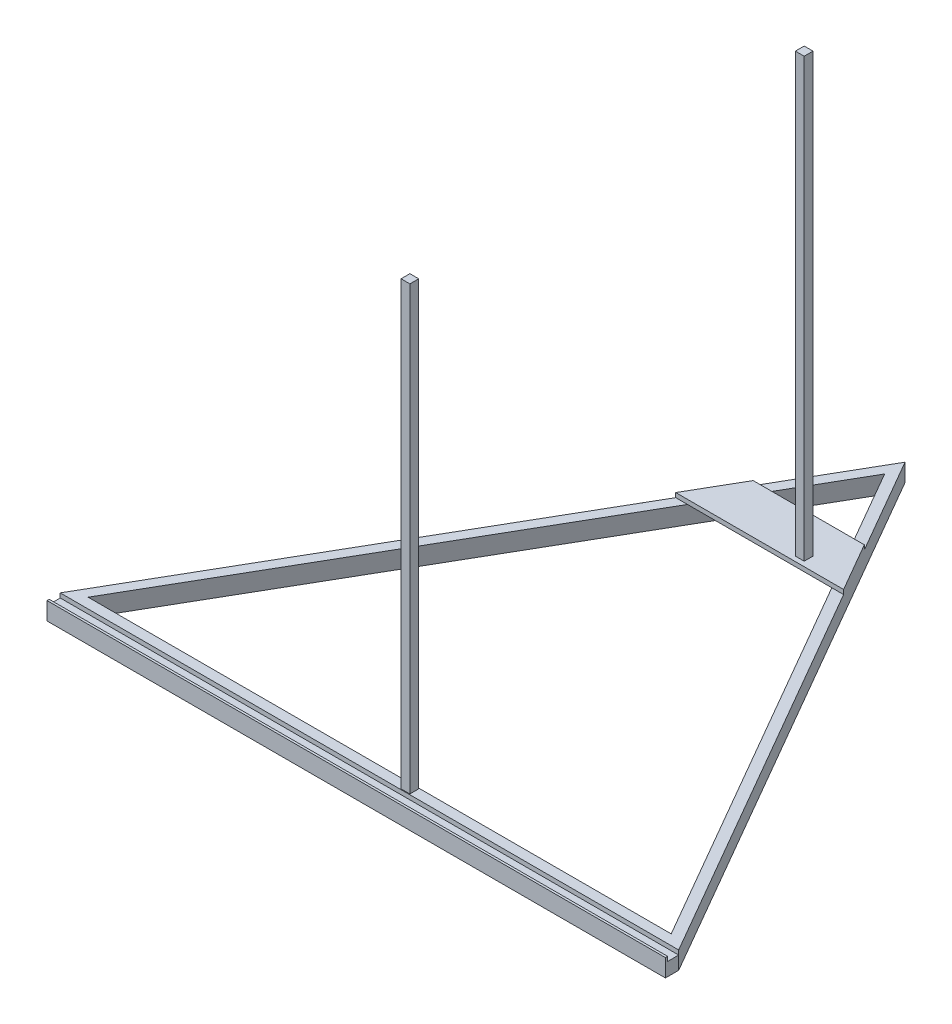
ISO-10303-21;
HEADER;
FILE_DESCRIPTION(('STEP AP214'),'2;1');
FILE_NAME('part.step','',(''),(''),'','','');
FILE_SCHEMA(('AUTOMOTIVE_DESIGN { 1 0 10303 214 1 1 1 1 }'));
ENDSEC;
DATA;
#1=APPLICATION_CONTEXT('core data for automotive mechanical design processes');
#2=APPLICATION_PROTOCOL_DEFINITION('international standard','automotive_design',2000,#1);
#3=PRODUCT_CONTEXT('',#1,'mechanical');
#4=PRODUCT('Part','Part','',(#3));
#5=PRODUCT_RELATED_PRODUCT_CATEGORY('part','',(#4));
#6=PRODUCT_DEFINITION_FORMATION('','',#4);
#7=PRODUCT_DEFINITION_CONTEXT('part definition',#1,'design');
#8=PRODUCT_DEFINITION('design','',#6,#7);
#9=PRODUCT_DEFINITION_SHAPE('','',#8);
#10=(LENGTH_UNIT() NAMED_UNIT(*) SI_UNIT(.MILLI.,.METRE.));
#11=(NAMED_UNIT(*) PLANE_ANGLE_UNIT() SI_UNIT($,.RADIAN.));
#12=(NAMED_UNIT(*) SI_UNIT($,.STERADIAN.) SOLID_ANGLE_UNIT());
#13=UNCERTAINTY_MEASURE_WITH_UNIT(LENGTH_MEASURE(1.E-05),#10,'distance_accuracy_value','');
#14=(GEOMETRIC_REPRESENTATION_CONTEXT(3) GLOBAL_UNCERTAINTY_ASSIGNED_CONTEXT((#13)) GLOBAL_UNIT_ASSIGNED_CONTEXT((#10,
#11,#12)) REPRESENTATION_CONTEXT('',''));
#15=CARTESIAN_POINT('',(0.,0.,0.));
#16=DIRECTION('',(0.,0.,1.));
#17=DIRECTION('',(1.,0.,0.));
#18=AXIS2_PLACEMENT_3D('',#15,#16,#17);
#19=CARTESIAN_POINT('',(0.,20.,0.));
#20=DIRECTION('',(0.,1.,0.));
#21=DIRECTION('',(0.,0.,1.));
#22=AXIS2_PLACEMENT_3D('',#19,#20,#21);
#23=PLANE('',#22);
#24=DIRECTION('',(1.,0.,0.));
#25=VECTOR('',#24,1.);
#26=CARTESIAN_POINT('',(350.,20.,214.572594216369));
#27=LINE('',#26,#25);
#28=CARTESIAN_POINT('',(-350.,20.,214.572594216369));
#29=VERTEX_POINT('',#28);
#30=CARTESIAN_POINT('',(350.,20.,214.572594216369));
#31=VERTEX_POINT('',#30);
#32=EDGE_CURVE('E216',#29,#31,#27,.T.);
#33=ORIENTED_EDGE('',*,*,#32,.F.);
#34=DIRECTION('',(0.,0.,1.));
#35=VECTOR('',#34,1.);
#36=CARTESIAN_POINT('',(-350.,20.,202.072594216369));
#37=LINE('',#36,#35);
#38=CARTESIAN_POINT('',(-350.,20.,217.072594216369));
#39=VERTEX_POINT('',#38);
#40=EDGE_CURVE('E279',#29,#39,#37,.T.);
#41=ORIENTED_EDGE('',*,*,#40,.T.);
#42=DIRECTION('',(1.,0.,0.));
#43=VECTOR('',#42,1.);
#44=CARTESIAN_POINT('',(-350.,20.,217.072594216369));
#45=LINE('',#44,#43);
#46=CARTESIAN_POINT('',(350.,20.,217.072594216369));
#47=VERTEX_POINT('',#46);
#48=EDGE_CURVE('E288',#39,#47,#45,.T.);
#49=ORIENTED_EDGE('',*,*,#48,.T.);
#50=DIRECTION('',(0.,0.,1.));
#51=VECTOR('',#50,1.);
#52=CARTESIAN_POINT('',(350.,20.,202.072594216369));
#53=LINE('',#52,#51);
#54=EDGE_CURVE('E277',#31,#47,#53,.T.);
#55=ORIENTED_EDGE('',*,*,#54,.F.);
#56=EDGE_LOOP('',(#33,#41,#49,#55));
#57=FACE_BOUND('',#56,.T.);
#58=ADVANCED_FACE('F33',(#57),#23,.T.);
#59=CARTESIAN_POINT('',(0.,25.,0.));
#60=DIRECTION('',(0.,1.,0.));
#61=DIRECTION('',(0.,0.,1.));
#62=AXIS2_PLACEMENT_3D('',#59,#60,#61);
#63=PLANE('',#62);
#64=DIRECTION('',(-0.5,0.,-0.866025403784438));
#65=VECTOR('',#64,1.);
#66=CARTESIAN_POINT('',(95.0000000000002,25.,-239.600361713695));
#67=LINE('',#66,#65);
#68=CARTESIAN_POINT('',(95.0000000000002,25.,-239.600361713695));
#69=VERTEX_POINT('',#68);
#70=CARTESIAN_POINT('',(62.9420736397741,25.,-295.126318954908));
#71=VERTEX_POINT('',#70);
#72=EDGE_CURVE('E335',#69,#71,#67,.T.);
#73=ORIENTED_EDGE('',*,*,#72,.T.);
#74=DIRECTION('',(-1.,0.,0.));
#75=VECTOR('',#74,1.);
#76=CARTESIAN_POINT('',(62.9420736397741,25.,-295.126318954908));
#77=LINE('',#76,#75);
#78=CARTESIAN_POINT('',(-62.942073639774,25.,-295.126318954908));
#79=VERTEX_POINT('',#78);
#80=EDGE_CURVE('E345',#71,#79,#77,.T.);
#81=ORIENTED_EDGE('',*,*,#80,.T.);
#82=DIRECTION('',(-0.5,0.,0.866025403784439));
#83=VECTOR('',#82,1.);
#84=CARTESIAN_POINT('',(-62.942073639774,25.,-295.126318954908));
#85=LINE('',#84,#83);
#86=CARTESIAN_POINT('',(-95.,25.,-239.600361713695));
#87=VERTEX_POINT('',#86);
#88=EDGE_CURVE('E343',#79,#87,#85,.T.);
#89=ORIENTED_EDGE('',*,*,#88,.T.);
#90=DIRECTION('',(1.,0.,0.));
#91=VECTOR('',#90,1.);
#92=CARTESIAN_POINT('',(-95.,25.,-239.600361713695));
#93=LINE('',#92,#91);
#94=EDGE_CURVE('E332',#87,#69,#93,.T.);
#95=ORIENTED_EDGE('',*,*,#94,.T.);
#96=EDGE_LOOP('',(#73,#81,#89,#95));
#97=FACE_BOUND('',#96,.T.);
#98=DIRECTION('',(1.,0.,0.));
#99=VECTOR('',#98,1.);
#100=CARTESIAN_POINT('',(34.9999999999999,25.,-245.));
#101=LINE('',#100,#99);
#102=CARTESIAN_POINT('',(34.9999999999999,25.,-245.));
#103=VERTEX_POINT('',#102);
#104=CARTESIAN_POINT('',(45.,25.,-245.));
#105=VERTEX_POINT('',#104);
#106=EDGE_CURVE('E364',#103,#105,#101,.T.);
#107=ORIENTED_EDGE('',*,*,#106,.F.);
#108=DIRECTION('',(0.,0.,1.));
#109=VECTOR('',#108,1.);
#110=CARTESIAN_POINT('',(35.,25.,-255.));
#111=LINE('',#110,#109);
#112=CARTESIAN_POINT('',(35.,25.,-255.));
#113=VERTEX_POINT('',#112);
#114=EDGE_CURVE('E366',#113,#103,#111,.T.);
#115=ORIENTED_EDGE('',*,*,#114,.F.);
#116=DIRECTION('',(-1.,0.,0.));
#117=VECTOR('',#116,1.);
#118=CARTESIAN_POINT('',(45.0000000000001,25.,-255.));
#119=LINE('',#118,#117);
#120=CARTESIAN_POINT('',(45.0000000000001,25.,-255.));
#121=VERTEX_POINT('',#120);
#122=EDGE_CURVE('E359',#121,#113,#119,.T.);
#123=ORIENTED_EDGE('',*,*,#122,.F.);
#124=DIRECTION('',(0.,0.,-1.));
#125=VECTOR('',#124,1.);
#126=CARTESIAN_POINT('',(45.,25.,-245.));
#127=LINE('',#126,#125);
#128=EDGE_CURVE('E362',#105,#121,#127,.T.);
#129=ORIENTED_EDGE('',*,*,#128,.F.);
#130=EDGE_LOOP('',(#107,#115,#123,#129));
#131=FACE_BOUND('',#130,.T.);
#132=ADVANCED_FACE('F430',(#97,#131),#63,.T.);
#133=DIRECTION('',(-0.5,0.,0.866025403784439));
#134=VECTOR('',#133,1.);
#135=CARTESIAN_POINT('',(0.,20.,-404.145188432738));
#136=LINE('',#135,#134);
#137=CARTESIAN_POINT('',(0.,20.,-404.145188432738));
#138=VERTEX_POINT('',#137);
#139=CARTESIAN_POINT('',(-62.942073639774,20.,-295.126318954908));
#140=VERTEX_POINT('',#139);
#141=EDGE_CURVE('E226',#138,#140,#136,.T.);
#142=ORIENTED_EDGE('',*,*,#141,.T.);
#143=DIRECTION('',(-1.,0.,0.));
#144=VECTOR('',#143,1.);
#145=CARTESIAN_POINT('',(62.9420736397741,20.,-295.126318954908));
#146=LINE('',#145,#144);
#147=CARTESIAN_POINT('',(-49.6087403064406,20.,-295.126318954908));
#148=VERTEX_POINT('',#147);
#149=EDGE_CURVE('E341',#148,#140,#146,.T.);
#150=ORIENTED_EDGE('',*,*,#149,.F.);
#151=DIRECTION('',(-0.5,0.,0.866025403784439));
#152=VECTOR('',#151,1.);
#153=CARTESIAN_POINT('',(0.,20.,-381.051177665153));
#154=LINE('',#153,#152);
#155=CARTESIAN_POINT('',(0.,20.,-381.051177665153));
#156=VERTEX_POINT('',#155);
#157=EDGE_CURVE('E265',#156,#148,#154,.T.);
#158=ORIENTED_EDGE('',*,*,#157,.F.);
#159=DIRECTION('',(-0.5,0.,-0.866025403784439));
#160=VECTOR('',#159,1.);
#161=CARTESIAN_POINT('',(330.,20.,190.525588832576));
#162=LINE('',#161,#160);
#163=CARTESIAN_POINT('',(49.6087403064406,20.,-295.126318954908));
#164=VERTEX_POINT('',#163);
#165=EDGE_CURVE('E256',#164,#156,#162,.T.);
#166=ORIENTED_EDGE('',*,*,#165,.F.);
#167=CARTESIAN_POINT('',(62.9420736397741,20.,-295.126318954908));
#168=VERTEX_POINT('',#167);
#169=EDGE_CURVE('E338',#168,#164,#146,.T.);
#170=ORIENTED_EDGE('',*,*,#169,.F.);
#171=DIRECTION('',(-0.5,0.,-0.866025403784438));
#172=VECTOR('',#171,1.);
#173=CARTESIAN_POINT('',(350.,20.,202.072594216369));
#174=LINE('',#173,#172);
#175=EDGE_CURVE('E237',#168,#138,#174,.T.);
#176=ORIENTED_EDGE('',*,*,#175,.T.);
#177=EDGE_LOOP('',(#142,#150,#158,#166,#170,#176));
#178=FACE_BOUND('',#177,.T.);
#179=ADVANCED_FACE('F413',(#178),#23,.T.);
#180=DIRECTION('',(-1.,0.,0.));
#181=VECTOR('',#180,1.);
#182=CARTESIAN_POINT('',(350.,20.,202.072594216369));
#183=LINE('',#182,#181);
#184=CARTESIAN_POINT('',(350.,20.,202.072594216369));
#185=VERTEX_POINT('',#184);
#186=CARTESIAN_POINT('',(-350.,20.,202.072594216369));
#187=VERTEX_POINT('',#186);
#188=EDGE_CURVE('E381',#185,#187,#183,.T.);
#189=ORIENTED_EDGE('',*,*,#188,.F.);
#190=CARTESIAN_POINT('',(95.0000000000002,20.,-239.600361713695));
#191=VERTEX_POINT('',#190);
#192=EDGE_CURVE('E231',#185,#191,#174,.T.);
#193=ORIENTED_EDGE('',*,*,#192,.T.);
#194=DIRECTION('',(1.,0.,0.));
#195=VECTOR('',#194,1.);
#196=CARTESIAN_POINT('',(-95.,20.,-239.600361713695));
#197=LINE('',#196,#195);
#198=CARTESIAN_POINT('',(81.6666666666666,20.,-239.600361713695));
#199=VERTEX_POINT('',#198);
#200=EDGE_CURVE('E337',#199,#191,#197,.T.);
#201=ORIENTED_EDGE('',*,*,#200,.F.);
#202=CARTESIAN_POINT('',(330.,20.,190.525588832576));
#203=VERTEX_POINT('',#202);
#204=EDGE_CURVE('E270',#203,#199,#162,.T.);
#205=ORIENTED_EDGE('',*,*,#204,.F.);
#206=DIRECTION('',(1.,0.,0.));
#207=VECTOR('',#206,1.);
#208=CARTESIAN_POINT('',(-330.,20.,190.525588832577));
#209=LINE('',#208,#207);
#210=CARTESIAN_POINT('',(-330.,20.,190.525588832577));
#211=VERTEX_POINT('',#210);
#212=EDGE_CURVE('E252',#211,#203,#209,.T.);
#213=ORIENTED_EDGE('',*,*,#212,.F.);
#214=CARTESIAN_POINT('',(-81.6666666666667,20.,-239.600361713695));
#215=VERTEX_POINT('',#214);
#216=EDGE_CURVE('E269',#215,#211,#154,.T.);
#217=ORIENTED_EDGE('',*,*,#216,.F.);
#218=CARTESIAN_POINT('',(-95.,20.,-239.600361713695));
#219=VERTEX_POINT('',#218);
#220=EDGE_CURVE('E333',#219,#215,#197,.T.);
#221=ORIENTED_EDGE('',*,*,#220,.F.);
#222=EDGE_CURVE('E243',#219,#187,#136,.T.);
#223=ORIENTED_EDGE('',*,*,#222,.T.);
#224=EDGE_LOOP('',(#189,#193,#201,#205,#213,#217,#221,#223));
#225=FACE_BOUND('',#224,.T.);
#226=DIRECTION('',(1.,0.,0.));
#227=VECTOR('',#226,1.);
#228=CARTESIAN_POINT('',(35.0000000000001,20.,201.3));
#229=LINE('',#228,#227);
#230=CARTESIAN_POINT('',(35.0000000000001,20.,201.3));
#231=VERTEX_POINT('',#230);
#232=CARTESIAN_POINT('',(45.0000000000001,20.,201.3));
#233=VERTEX_POINT('',#232);
#234=EDGE_CURVE('E308',#231,#233,#229,.T.);
#235=ORIENTED_EDGE('',*,*,#234,.F.);
#236=DIRECTION('',(0.,0.,1.));
#237=VECTOR('',#236,1.);
#238=CARTESIAN_POINT('',(34.9999999999998,20.,191.3));
#239=LINE('',#238,#237);
#240=CARTESIAN_POINT('',(34.9999999999998,20.,191.3));
#241=VERTEX_POINT('',#240);
#242=EDGE_CURVE('E310',#241,#231,#239,.T.);
#243=ORIENTED_EDGE('',*,*,#242,.F.);
#244=DIRECTION('',(-1.,0.,0.));
#245=VECTOR('',#244,1.);
#246=CARTESIAN_POINT('',(44.9999999999999,20.,191.3));
#247=LINE('',#246,#245);
#248=CARTESIAN_POINT('',(44.9999999999999,20.,191.3));
#249=VERTEX_POINT('',#248);
#250=EDGE_CURVE('E302',#249,#241,#247,.T.);
#251=ORIENTED_EDGE('',*,*,#250,.F.);
#252=DIRECTION('',(0.,0.,-1.));
#253=VECTOR('',#252,1.);
#254=CARTESIAN_POINT('',(45.0000000000001,20.,201.3));
#255=LINE('',#254,#253);
#256=EDGE_CURVE('E305',#233,#249,#255,.T.);
#257=ORIENTED_EDGE('',*,*,#256,.F.);
#258=EDGE_LOOP('',(#235,#243,#251,#257));
#259=FACE_BOUND('',#258,.T.);
#260=ADVANCED_FACE('F437',(#225,#259),#23,.T.);
#261=CARTESIAN_POINT('',(0.,0.,0.));
#262=DIRECTION('',(0.,1.,0.));
#263=DIRECTION('',(0.,0.,1.));
#264=AXIS2_PLACEMENT_3D('',#261,#262,#263);
#265=PLANE('',#264);
#266=DIRECTION('',(-0.5,0.,-0.866025403784438));
#267=VECTOR('',#266,1.);
#268=CARTESIAN_POINT('',(350.,0.,202.072594216369));
#269=LINE('',#268,#267);
#270=CARTESIAN_POINT('',(350.,0.,202.072594216369));
#271=VERTEX_POINT('',#270);
#272=CARTESIAN_POINT('',(0.,0.,-404.145188432738));
#273=VERTEX_POINT('',#272);
#274=EDGE_CURVE('E238',#271,#273,#269,.T.);
#275=ORIENTED_EDGE('',*,*,#274,.F.);
#276=DIRECTION('',(0.,0.,1.));
#277=VECTOR('',#276,1.);
#278=CARTESIAN_POINT('',(350.,0.,202.072594216369));
#279=LINE('',#278,#277);
#280=CARTESIAN_POINT('',(350.,0.,217.072594216369));
#281=VERTEX_POINT('',#280);
#282=EDGE_CURVE('E222',#271,#281,#279,.T.);
#283=ORIENTED_EDGE('',*,*,#282,.T.);
#284=DIRECTION('',(1.,0.,0.));
#285=VECTOR('',#284,1.);
#286=CARTESIAN_POINT('',(-350.,0.,217.072594216369));
#287=LINE('',#286,#285);
#288=CARTESIAN_POINT('',(-350.,0.,217.072594216369));
#289=VERTEX_POINT('',#288);
#290=EDGE_CURVE('E280',#289,#281,#287,.T.);
#291=ORIENTED_EDGE('',*,*,#290,.F.);
#292=DIRECTION('',(0.,0.,1.));
#293=VECTOR('',#292,1.);
#294=CARTESIAN_POINT('',(-350.,0.,202.072594216369));
#295=LINE('',#294,#293);
#296=CARTESIAN_POINT('',(-350.,0.,202.072594216369));
#297=VERTEX_POINT('',#296);
#298=EDGE_CURVE('E283',#297,#289,#295,.T.);
#299=ORIENTED_EDGE('',*,*,#298,.F.);
#300=DIRECTION('',(-0.5,0.,0.866025403784439));
#301=VECTOR('',#300,1.);
#302=CARTESIAN_POINT('',(0.,0.,-404.145188432738));
#303=LINE('',#302,#301);
#304=EDGE_CURVE('E234',#273,#297,#303,.T.);
#305=ORIENTED_EDGE('',*,*,#304,.F.);
#306=EDGE_LOOP('',(#275,#283,#291,#299,#305));
#307=FACE_BOUND('',#306,.T.);
#308=DIRECTION('',(-0.5,0.,-0.866025403784439));
#309=VECTOR('',#308,1.);
#310=CARTESIAN_POINT('',(330.,0.,190.525588832576));
#311=LINE('',#310,#309);
#312=CARTESIAN_POINT('',(330.,0.,190.525588832576));
#313=VERTEX_POINT('',#312);
#314=CARTESIAN_POINT('',(0.,0.,-381.051177665153));
#315=VERTEX_POINT('',#314);
#316=EDGE_CURVE('E260',#313,#315,#311,.T.);
#317=ORIENTED_EDGE('',*,*,#316,.T.);
#318=DIRECTION('',(-0.5,0.,0.866025403784439));
#319=VECTOR('',#318,1.);
#320=CARTESIAN_POINT('',(0.,0.,-381.051177665153));
#321=LINE('',#320,#319);
#322=CARTESIAN_POINT('',(-330.,0.,190.525588832577));
#323=VERTEX_POINT('',#322);
#324=EDGE_CURVE('E257',#315,#323,#321,.T.);
#325=ORIENTED_EDGE('',*,*,#324,.T.);
#326=DIRECTION('',(1.,0.,0.));
#327=VECTOR('',#326,1.);
#328=CARTESIAN_POINT('',(-330.,0.,190.525588832577));
#329=LINE('',#328,#327);
#330=EDGE_CURVE('E253',#323,#313,#329,.T.);
#331=ORIENTED_EDGE('',*,*,#330,.T.);
#332=EDGE_LOOP('',(#317,#325,#331));
#333=FACE_BOUND('',#332,.T.);
#334=ADVANCED_FACE('F401',(#307,#333),#265,.F.);
#335=CARTESIAN_POINT('',(350.,20.,202.072594216369));
#336=DIRECTION('',(-0.866025403784439,0.,0.5));
#337=DIRECTION('',(0.5,0.,0.866025403784439));
#338=AXIS2_PLACEMENT_3D('',#335,#336,#337);
#339=PLANE('',#338);
#340=ORIENTED_EDGE('',*,*,#274,.T.);
#341=DIRECTION('',(0.,-1.,0.));
#342=VECTOR('',#341,1.);
#343=CARTESIAN_POINT('',(0.,20.,-404.145188432738));
#344=LINE('',#343,#342);
#345=EDGE_CURVE('E11',#138,#273,#344,.T.);
#346=ORIENTED_EDGE('',*,*,#345,.F.);
#347=ORIENTED_EDGE('',*,*,#175,.F.);
#348=DIRECTION('',(0.,-1.,0.));
#349=VECTOR('',#348,1.);
#350=CARTESIAN_POINT('',(62.9420736397741,25.,-295.126318954908));
#351=LINE('',#350,#349);
#352=EDGE_CURVE('E323',#71,#168,#351,.T.);
#353=ORIENTED_EDGE('',*,*,#352,.F.);
#354=ORIENTED_EDGE('',*,*,#72,.F.);
#355=DIRECTION('',(0.,-1.,0.));
#356=VECTOR('',#355,1.);
#357=CARTESIAN_POINT('',(95.0000000000002,25.,-239.600361713695));
#358=LINE('',#357,#356);
#359=EDGE_CURVE('E330',#69,#191,#358,.T.);
#360=ORIENTED_EDGE('',*,*,#359,.T.);
#361=ORIENTED_EDGE('',*,*,#192,.F.);
#362=DIRECTION('',(0.,-1.,0.));
#363=VECTOR('',#362,1.);
#364=CARTESIAN_POINT('',(350.,20.,202.072594216369));
#365=LINE('',#364,#363);
#366=CARTESIAN_POINT('',(350.,15.,202.072594216369));
#367=VERTEX_POINT('',#366);
#368=EDGE_CURVE('E204',#185,#367,#365,.T.);
#369=ORIENTED_EDGE('',*,*,#368,.T.);
#370=EDGE_CURVE('E219',#367,#271,#365,.T.);
#371=ORIENTED_EDGE('',*,*,#370,.T.);
#372=EDGE_LOOP('',(#340,#346,#347,#353,#354,#360,#361,#369,#371));
#373=FACE_BOUND('',#372,.T.);
#374=ADVANCED_FACE('F35',(#373),#339,.F.);
#375=CARTESIAN_POINT('',(0.,20.,-404.145188432738));
#376=DIRECTION('',(0.866025403784439,0.,0.5));
#377=DIRECTION('',(0.5,0.,-0.866025403784439));
#378=AXIS2_PLACEMENT_3D('',#375,#376,#377);
#379=PLANE('',#378);
#380=ORIENTED_EDGE('',*,*,#304,.T.);
#381=DIRECTION('',(0.,-1.,0.));
#382=VECTOR('',#381,1.);
#383=CARTESIAN_POINT('',(-350.,20.,202.072594216369));
#384=LINE('',#383,#382);
#385=CARTESIAN_POINT('',(-350.,15.,202.072594216369));
#386=VERTEX_POINT('',#385);
#387=EDGE_CURVE('E232',#386,#297,#384,.T.);
#388=ORIENTED_EDGE('',*,*,#387,.F.);
#389=EDGE_CURVE('E41',#187,#386,#384,.T.);
#390=ORIENTED_EDGE('',*,*,#389,.F.);
#391=ORIENTED_EDGE('',*,*,#222,.F.);
#392=DIRECTION('',(0.,-1.,0.));
#393=VECTOR('',#392,1.);
#394=CARTESIAN_POINT('',(-95.,25.,-239.600361713695));
#395=LINE('',#394,#393);
#396=EDGE_CURVE('E328',#87,#219,#395,.T.);
#397=ORIENTED_EDGE('',*,*,#396,.F.);
#398=ORIENTED_EDGE('',*,*,#88,.F.);
#399=DIRECTION('',(0.,-1.,0.));
#400=VECTOR('',#399,1.);
#401=CARTESIAN_POINT('',(-62.942073639774,25.,-295.126318954908));
#402=LINE('',#401,#400);
#403=EDGE_CURVE('E325',#79,#140,#402,.T.);
#404=ORIENTED_EDGE('',*,*,#403,.T.);
#405=ORIENTED_EDGE('',*,*,#141,.F.);
#406=ORIENTED_EDGE('',*,*,#345,.T.);
#407=EDGE_LOOP('',(#380,#388,#390,#391,#397,#398,#404,#405,#406));
#408=FACE_BOUND('',#407,.T.);
#409=ADVANCED_FACE('F408',(#408),#379,.F.);
#410=CARTESIAN_POINT('',(330.,20.,190.525588832576));
#411=DIRECTION('',(-0.866025403784439,0.,0.5));
#412=DIRECTION('',(0.5,0.,0.866025403784439));
#413=AXIS2_PLACEMENT_3D('',#410,#411,#412);
#414=PLANE('',#413);
#415=ORIENTED_EDGE('',*,*,#316,.F.);
#416=DIRECTION('',(0.,-1.,0.));
#417=VECTOR('',#416,1.);
#418=CARTESIAN_POINT('',(330.,20.,190.525588832576));
#419=LINE('',#418,#417);
#420=EDGE_CURVE('E249',#203,#313,#419,.T.);
#421=ORIENTED_EDGE('',*,*,#420,.F.);
#422=ORIENTED_EDGE('',*,*,#204,.T.);
#423=DIRECTION('',(-0.5,0.,-0.866025403784439));
#424=VECTOR('',#423,1.);
#425=CARTESIAN_POINT('',(330.,20.,190.525588832576));
#426=LINE('',#425,#424);
#427=EDGE_CURVE('E313',#199,#164,#426,.T.);
#428=ORIENTED_EDGE('',*,*,#427,.T.);
#429=ORIENTED_EDGE('',*,*,#165,.T.);
#430=DIRECTION('',(0.,-1.,0.));
#431=VECTOR('',#430,1.);
#432=CARTESIAN_POINT('',(0.,20.,-381.051177665153));
#433=LINE('',#432,#431);
#434=EDGE_CURVE('E240',#156,#315,#433,.T.);
#435=ORIENTED_EDGE('',*,*,#434,.T.);
#436=EDGE_LOOP('',(#415,#421,#422,#428,#429,#435));
#437=FACE_BOUND('',#436,.T.);
#438=ADVANCED_FACE('F493',(#437),#414,.T.);
#439=CARTESIAN_POINT('',(0.,20.,-381.051177665153));
#440=DIRECTION('',(0.866025403784438,0.,0.5));
#441=DIRECTION('',(0.5,0.,-0.866025403784439));
#442=AXIS2_PLACEMENT_3D('',#439,#440,#441);
#443=PLANE('',#442);
#444=ORIENTED_EDGE('',*,*,#324,.F.);
#445=ORIENTED_EDGE('',*,*,#434,.F.);
#446=ORIENTED_EDGE('',*,*,#157,.T.);
#447=EDGE_CURVE('E268',#148,#215,#154,.T.);
#448=ORIENTED_EDGE('',*,*,#447,.T.);
#449=ORIENTED_EDGE('',*,*,#216,.T.);
#450=DIRECTION('',(0.,-1.,0.));
#451=VECTOR('',#450,1.);
#452=CARTESIAN_POINT('',(-330.,20.,190.525588832577));
#453=LINE('',#452,#451);
#454=EDGE_CURVE('E247',#211,#323,#453,.T.);
#455=ORIENTED_EDGE('',*,*,#454,.T.);
#456=EDGE_LOOP('',(#444,#445,#446,#448,#449,#455));
#457=FACE_BOUND('',#456,.T.);
#458=ADVANCED_FACE('F499',(#457),#443,.T.);
#459=CARTESIAN_POINT('',(-330.,20.,190.525588832577));
#460=DIRECTION('',(0.,0.,-1.));
#461=DIRECTION('',(-1.,0.,0.));
#462=AXIS2_PLACEMENT_3D('',#459,#460,#461);
#463=PLANE('',#462);
#464=ORIENTED_EDGE('',*,*,#330,.F.);
#465=ORIENTED_EDGE('',*,*,#454,.F.);
#466=ORIENTED_EDGE('',*,*,#212,.T.);
#467=ORIENTED_EDGE('',*,*,#420,.T.);
#468=EDGE_LOOP('',(#464,#465,#466,#467));
#469=FACE_BOUND('',#468,.T.);
#470=ADVANCED_FACE('F506',(#469),#463,.T.);
#471=CARTESIAN_POINT('',(-350.,20.,202.072594216369));
#472=DIRECTION('',(1.,0.,0.));
#473=DIRECTION('',(0.,0.,-1.));
#474=AXIS2_PLACEMENT_3D('',#471,#472,#473);
#475=PLANE('',#474);
#476=ORIENTED_EDGE('',*,*,#40,.F.);
#477=DIRECTION('',(0.,1.,0.));
#478=VECTOR('',#477,1.);
#479=CARTESIAN_POINT('',(-350.,15.,214.572594216369));
#480=LINE('',#479,#478);
#481=CARTESIAN_POINT('',(-350.,15.,214.572594216369));
#482=VERTEX_POINT('',#481);
#483=EDGE_CURVE('E377',#482,#29,#480,.T.);
#484=ORIENTED_EDGE('',*,*,#483,.F.);
#485=DIRECTION('',(0.,0.,1.));
#486=VECTOR('',#485,1.);
#487=CARTESIAN_POINT('',(-350.,15.,202.072594216369));
#488=LINE('',#487,#486);
#489=EDGE_CURVE('E208',#386,#482,#488,.T.);
#490=ORIENTED_EDGE('',*,*,#489,.F.);
#491=ORIENTED_EDGE('',*,*,#387,.T.);
#492=ORIENTED_EDGE('',*,*,#298,.T.);
#493=DIRECTION('',(0.,-1.,0.));
#494=VECTOR('',#493,1.);
#495=CARTESIAN_POINT('',(-350.,20.,217.072594216369));
#496=LINE('',#495,#494);
#497=EDGE_CURVE('E263',#39,#289,#496,.T.);
#498=ORIENTED_EDGE('',*,*,#497,.F.);
#499=EDGE_LOOP('',(#476,#484,#490,#491,#492,#498));
#500=FACE_BOUND('',#499,.T.);
#501=ADVANCED_FACE('F391',(#500),#475,.F.);
#502=CARTESIAN_POINT('',(-350.,20.,217.072594216369));
#503=DIRECTION('',(0.,0.,-1.));
#504=DIRECTION('',(-1.,0.,0.));
#505=AXIS2_PLACEMENT_3D('',#502,#503,#504);
#506=PLANE('',#505);
#507=ORIENTED_EDGE('',*,*,#290,.T.);
#508=DIRECTION('',(0.,-1.,0.));
#509=VECTOR('',#508,1.);
#510=CARTESIAN_POINT('',(350.,20.,217.072594216369));
#511=LINE('',#510,#509);
#512=EDGE_CURVE('E275',#47,#281,#511,.T.);
#513=ORIENTED_EDGE('',*,*,#512,.F.);
#514=ORIENTED_EDGE('',*,*,#48,.F.);
#515=ORIENTED_EDGE('',*,*,#497,.T.);
#516=EDGE_LOOP('',(#507,#513,#514,#515));
#517=FACE_BOUND('',#516,.T.);
#518=ADVANCED_FACE('F398',(#517),#506,.F.);
#519=CARTESIAN_POINT('',(350.,20.,202.072594216369));
#520=DIRECTION('',(1.,0.,0.));
#521=DIRECTION('',(0.,0.,-1.));
#522=AXIS2_PLACEMENT_3D('',#519,#520,#521);
#523=PLANE('',#522);
#524=DIRECTION('',(0.,1.,0.));
#525=VECTOR('',#524,1.);
#526=CARTESIAN_POINT('',(350.,15.,214.572594216369));
#527=LINE('',#526,#525);
#528=CARTESIAN_POINT('',(350.,15.,214.572594216369));
#529=VERTEX_POINT('',#528);
#530=EDGE_CURVE('E369',#529,#31,#527,.T.);
#531=ORIENTED_EDGE('',*,*,#530,.T.);
#532=ORIENTED_EDGE('',*,*,#54,.T.);
#533=ORIENTED_EDGE('',*,*,#512,.T.);
#534=ORIENTED_EDGE('',*,*,#282,.F.);
#535=ORIENTED_EDGE('',*,*,#370,.F.);
#536=DIRECTION('',(0.,0.,-1.));
#537=VECTOR('',#536,1.);
#538=CARTESIAN_POINT('',(350.,15.,202.072594216369));
#539=LINE('',#538,#537);
#540=EDGE_CURVE('E209',#529,#367,#539,.T.);
#541=ORIENTED_EDGE('',*,*,#540,.F.);
#542=EDGE_LOOP('',(#531,#532,#533,#534,#535,#541));
#543=FACE_BOUND('',#542,.T.);
#544=ADVANCED_FACE('F220',(#543),#523,.T.);
#545=CARTESIAN_POINT('',(34.9999999999998,520.,191.3));
#546=DIRECTION('',(1.,0.,0.));
#547=DIRECTION('',(0.,0.,-1.));
#548=AXIS2_PLACEMENT_3D('',#545,#546,#547);
#549=PLANE('',#548);
#550=ORIENTED_EDGE('',*,*,#242,.T.);
#551=DIRECTION('',(0.,-1.,0.));
#552=VECTOR('',#551,1.);
#553=CARTESIAN_POINT('',(35.0000000000001,520.,201.3));
#554=LINE('',#553,#552);
#555=CARTESIAN_POINT('',(35.0000000000001,520.,201.3));
#556=VERTEX_POINT('',#555);
#557=EDGE_CURVE('E286',#556,#231,#554,.T.);
#558=ORIENTED_EDGE('',*,*,#557,.F.);
#559=DIRECTION('',(0.,0.,1.));
#560=VECTOR('',#559,1.);
#561=CARTESIAN_POINT('',(34.9999999999998,520.,191.3));
#562=LINE('',#561,#560);
#563=CARTESIAN_POINT('',(34.9999999999998,520.,191.3));
#564=VERTEX_POINT('',#563);
#565=EDGE_CURVE('E304',#564,#556,#562,.T.);
#566=ORIENTED_EDGE('',*,*,#565,.F.);
#567=DIRECTION('',(0.,-1.,0.));
#568=VECTOR('',#567,1.);
#569=CARTESIAN_POINT('',(34.9999999999998,520.,191.3));
#570=LINE('',#569,#568);
#571=EDGE_CURVE('E298',#564,#241,#570,.T.);
#572=ORIENTED_EDGE('',*,*,#571,.T.);
#573=EDGE_LOOP('',(#550,#558,#566,#572));
#574=FACE_BOUND('',#573,.T.);
#575=ADVANCED_FACE('F532',(#574),#549,.F.);
#576=CARTESIAN_POINT('',(35.0000000000001,520.,201.3));
#577=DIRECTION('',(0.,0.,-1.));
#578=DIRECTION('',(-1.,0.,0.));
#579=AXIS2_PLACEMENT_3D('',#576,#577,#578);
#580=PLANE('',#579);
#581=ORIENTED_EDGE('',*,*,#234,.T.);
#582=DIRECTION('',(0.,-1.,0.));
#583=VECTOR('',#582,1.);
#584=CARTESIAN_POINT('',(45.0000000000001,520.,201.3));
#585=LINE('',#584,#583);
#586=CARTESIAN_POINT('',(45.0000000000001,520.,201.3));
#587=VERTEX_POINT('',#586);
#588=EDGE_CURVE('E293',#587,#233,#585,.T.);
#589=ORIENTED_EDGE('',*,*,#588,.F.);
#590=DIRECTION('',(1.,0.,0.));
#591=VECTOR('',#590,1.);
#592=CARTESIAN_POINT('',(35.0000000000001,520.,201.3));
#593=LINE('',#592,#591);
#594=EDGE_CURVE('E317',#556,#587,#593,.T.);
#595=ORIENTED_EDGE('',*,*,#594,.F.);
#596=ORIENTED_EDGE('',*,*,#557,.T.);
#597=EDGE_LOOP('',(#581,#589,#595,#596));
#598=FACE_BOUND('',#597,.T.);
#599=ADVANCED_FACE('F539',(#598),#580,.F.);
#600=CARTESIAN_POINT('',(45.0000000000001,520.,201.3));
#601=DIRECTION('',(-1.,0.,0.));
#602=DIRECTION('',(0.,0.,1.));
#603=AXIS2_PLACEMENT_3D('',#600,#601,#602);
#604=PLANE('',#603);
#605=ORIENTED_EDGE('',*,*,#256,.T.);
#606=DIRECTION('',(0.,-1.,0.));
#607=VECTOR('',#606,1.);
#608=CARTESIAN_POINT('',(44.9999999999999,520.,191.3));
#609=LINE('',#608,#607);
#610=CARTESIAN_POINT('',(44.9999999999999,520.,191.3));
#611=VERTEX_POINT('',#610);
#612=EDGE_CURVE('E296',#611,#249,#609,.T.);
#613=ORIENTED_EDGE('',*,*,#612,.F.);
#614=DIRECTION('',(0.,0.,-1.));
#615=VECTOR('',#614,1.);
#616=CARTESIAN_POINT('',(45.0000000000001,520.,201.3));
#617=LINE('',#616,#615);
#618=EDGE_CURVE('E315',#587,#611,#617,.T.);
#619=ORIENTED_EDGE('',*,*,#618,.F.);
#620=ORIENTED_EDGE('',*,*,#588,.T.);
#621=EDGE_LOOP('',(#605,#613,#619,#620));
#622=FACE_BOUND('',#621,.T.);
#623=ADVANCED_FACE('F547',(#622),#604,.F.);
#624=CARTESIAN_POINT('',(44.9999999999999,520.,191.3));
#625=DIRECTION('',(0.,0.,1.));
#626=DIRECTION('',(1.,0.,0.));
#627=AXIS2_PLACEMENT_3D('',#624,#625,#626);
#628=PLANE('',#627);
#629=ORIENTED_EDGE('',*,*,#250,.T.);
#630=ORIENTED_EDGE('',*,*,#571,.F.);
#631=DIRECTION('',(-1.,0.,0.));
#632=VECTOR('',#631,1.);
#633=CARTESIAN_POINT('',(44.9999999999999,520.,191.3));
#634=LINE('',#633,#632);
#635=EDGE_CURVE('E301',#611,#564,#634,.T.);
#636=ORIENTED_EDGE('',*,*,#635,.F.);
#637=ORIENTED_EDGE('',*,*,#612,.T.);
#638=EDGE_LOOP('',(#629,#630,#636,#637));
#639=FACE_BOUND('',#638,.T.);
#640=ADVANCED_FACE('F555',(#639),#628,.F.);
#641=CARTESIAN_POINT('',(0.,520.,0.));
#642=DIRECTION('',(0.,1.,0.));
#643=DIRECTION('',(0.,0.,1.));
#644=AXIS2_PLACEMENT_3D('',#641,#642,#643);
#645=PLANE('',#644);
#646=ORIENTED_EDGE('',*,*,#565,.T.);
#647=ORIENTED_EDGE('',*,*,#594,.T.);
#648=ORIENTED_EDGE('',*,*,#618,.T.);
#649=ORIENTED_EDGE('',*,*,#635,.T.);
#650=EDGE_LOOP('',(#646,#647,#648,#649));
#651=FACE_BOUND('',#650,.T.);
#652=ADVANCED_FACE('F453',(#651),#645,.T.);
#653=CARTESIAN_POINT('',(62.9420736397741,25.,-295.126318954908));
#654=DIRECTION('',(0.,0.,1.));
#655=DIRECTION('',(1.,0.,0.));
#656=AXIS2_PLACEMENT_3D('',#653,#654,#655);
#657=PLANE('',#656);
#658=ORIENTED_EDGE('',*,*,#169,.T.);
#659=EDGE_CURVE('E340',#164,#148,#146,.T.);
#660=ORIENTED_EDGE('',*,*,#659,.T.);
#661=ORIENTED_EDGE('',*,*,#149,.T.);
#662=ORIENTED_EDGE('',*,*,#403,.F.);
#663=ORIENTED_EDGE('',*,*,#80,.F.);
#664=ORIENTED_EDGE('',*,*,#352,.T.);
#665=EDGE_LOOP('',(#658,#660,#661,#662,#663,#664));
#666=FACE_BOUND('',#665,.T.);
#667=ADVANCED_FACE('F420',(#666),#657,.F.);
#668=CARTESIAN_POINT('',(-95.,25.,-239.600361713695));
#669=DIRECTION('',(0.,0.,-1.));
#670=DIRECTION('',(-1.,0.,0.));
#671=AXIS2_PLACEMENT_3D('',#668,#669,#670);
#672=PLANE('',#671);
#673=ORIENTED_EDGE('',*,*,#220,.T.);
#674=EDGE_CURVE('E336',#215,#199,#197,.T.);
#675=ORIENTED_EDGE('',*,*,#674,.T.);
#676=ORIENTED_EDGE('',*,*,#200,.T.);
#677=ORIENTED_EDGE('',*,*,#359,.F.);
#678=ORIENTED_EDGE('',*,*,#94,.F.);
#679=ORIENTED_EDGE('',*,*,#396,.T.);
#680=EDGE_LOOP('',(#673,#675,#676,#677,#678,#679));
#681=FACE_BOUND('',#680,.T.);
#682=ADVANCED_FACE('F444',(#681),#672,.F.);
#683=CARTESIAN_POINT('',(0.,20.,0.));
#684=DIRECTION('',(0.,1.,0.));
#685=DIRECTION('',(0.,0.,1.));
#686=AXIS2_PLACEMENT_3D('',#683,#684,#685);
#687=PLANE('',#686);
#688=ORIENTED_EDGE('',*,*,#427,.F.);
#689=ORIENTED_EDGE('',*,*,#674,.F.);
#690=ORIENTED_EDGE('',*,*,#447,.F.);
#691=ORIENTED_EDGE('',*,*,#659,.F.);
#692=EDGE_LOOP('',(#688,#689,#690,#691));
#693=FACE_BOUND('',#692,.T.);
#694=ADVANCED_FACE('F422',(#693),#687,.F.);
#695=CARTESIAN_POINT('',(35.,520.,-255.));
#696=DIRECTION('',(1.,0.,0.));
#697=DIRECTION('',(0.,0.,-1.));
#698=AXIS2_PLACEMENT_3D('',#695,#696,#697);
#699=PLANE('',#698);
#700=ORIENTED_EDGE('',*,*,#114,.T.);
#701=DIRECTION('',(0.,-1.,0.));
#702=VECTOR('',#701,1.);
#703=CARTESIAN_POINT('',(34.9999999999999,520.,-245.));
#704=LINE('',#703,#702);
#705=CARTESIAN_POINT('',(34.9999999999999,520.,-245.));
#706=VERTEX_POINT('',#705);
#707=EDGE_CURVE('E349',#706,#103,#704,.T.);
#708=ORIENTED_EDGE('',*,*,#707,.F.);
#709=DIRECTION('',(0.,0.,1.));
#710=VECTOR('',#709,1.);
#711=CARTESIAN_POINT('',(35.,520.,-255.));
#712=LINE('',#711,#710);
#713=CARTESIAN_POINT('',(35.,520.,-255.));
#714=VERTEX_POINT('',#713);
#715=EDGE_CURVE('E361',#714,#706,#712,.T.);
#716=ORIENTED_EDGE('',*,*,#715,.F.);
#717=DIRECTION('',(0.,-1.,0.));
#718=VECTOR('',#717,1.);
#719=CARTESIAN_POINT('',(35.,520.,-255.));
#720=LINE('',#719,#718);
#721=EDGE_CURVE('E355',#714,#113,#720,.T.);
#722=ORIENTED_EDGE('',*,*,#721,.T.);
#723=EDGE_LOOP('',(#700,#708,#716,#722));
#724=FACE_BOUND('',#723,.T.);
#725=ADVANCED_FACE('F451',(#724),#699,.F.);
#726=CARTESIAN_POINT('',(34.9999999999999,520.,-245.));
#727=DIRECTION('',(0.,0.,-1.));
#728=DIRECTION('',(-1.,0.,0.));
#729=AXIS2_PLACEMENT_3D('',#726,#727,#728);
#730=PLANE('',#729);
#731=ORIENTED_EDGE('',*,*,#106,.T.);
#732=DIRECTION('',(0.,-1.,0.));
#733=VECTOR('',#732,1.);
#734=CARTESIAN_POINT('',(45.,520.,-245.));
#735=LINE('',#734,#733);
#736=CARTESIAN_POINT('',(45.,520.,-245.));
#737=VERTEX_POINT('',#736);
#738=EDGE_CURVE('E351',#737,#105,#735,.T.);
#739=ORIENTED_EDGE('',*,*,#738,.F.);
#740=DIRECTION('',(1.,0.,0.));
#741=VECTOR('',#740,1.);
#742=CARTESIAN_POINT('',(34.9999999999999,520.,-245.));
#743=LINE('',#742,#741);
#744=EDGE_CURVE('E373',#706,#737,#743,.T.);
#745=ORIENTED_EDGE('',*,*,#744,.F.);
#746=ORIENTED_EDGE('',*,*,#707,.T.);
#747=EDGE_LOOP('',(#731,#739,#745,#746));
#748=FACE_BOUND('',#747,.T.);
#749=ADVANCED_FACE('F596',(#748),#730,.F.);
#750=CARTESIAN_POINT('',(45.,520.,-245.));
#751=DIRECTION('',(-1.,0.,0.));
#752=DIRECTION('',(0.,0.,1.));
#753=AXIS2_PLACEMENT_3D('',#750,#751,#752);
#754=PLANE('',#753);
#755=ORIENTED_EDGE('',*,*,#128,.T.);
#756=DIRECTION('',(0.,-1.,0.));
#757=VECTOR('',#756,1.);
#758=CARTESIAN_POINT('',(45.0000000000001,520.,-255.));
#759=LINE('',#758,#757);
#760=CARTESIAN_POINT('',(45.0000000000001,520.,-255.));
#761=VERTEX_POINT('',#760);
#762=EDGE_CURVE('E56',#761,#121,#759,.T.);
#763=ORIENTED_EDGE('',*,*,#762,.F.);
#764=DIRECTION('',(0.,0.,-1.));
#765=VECTOR('',#764,1.);
#766=CARTESIAN_POINT('',(45.,520.,-245.));
#767=LINE('',#766,#765);
#768=EDGE_CURVE('E371',#737,#761,#767,.T.);
#769=ORIENTED_EDGE('',*,*,#768,.F.);
#770=ORIENTED_EDGE('',*,*,#738,.T.);
#771=EDGE_LOOP('',(#755,#763,#769,#770));
#772=FACE_BOUND('',#771,.T.);
#773=ADVANCED_FACE('F606',(#772),#754,.F.);
#774=CARTESIAN_POINT('',(45.0000000000001,520.,-255.));
#775=DIRECTION('',(0.,0.,1.));
#776=DIRECTION('',(1.,0.,0.));
#777=AXIS2_PLACEMENT_3D('',#774,#775,#776);
#778=PLANE('',#777);
#779=ORIENTED_EDGE('',*,*,#122,.T.);
#780=ORIENTED_EDGE('',*,*,#721,.F.);
#781=DIRECTION('',(-1.,0.,0.));
#782=VECTOR('',#781,1.);
#783=CARTESIAN_POINT('',(45.0000000000001,520.,-255.));
#784=LINE('',#783,#782);
#785=EDGE_CURVE('E358',#761,#714,#784,.T.);
#786=ORIENTED_EDGE('',*,*,#785,.F.);
#787=ORIENTED_EDGE('',*,*,#762,.T.);
#788=EDGE_LOOP('',(#779,#780,#786,#787));
#789=FACE_BOUND('',#788,.T.);
#790=ADVANCED_FACE('F616',(#789),#778,.F.);
#791=CARTESIAN_POINT('',(0.,520.,0.));
#792=DIRECTION('',(0.,1.,0.));
#793=DIRECTION('',(0.,0.,1.));
#794=AXIS2_PLACEMENT_3D('',#791,#792,#793);
#795=PLANE('',#794);
#796=ORIENTED_EDGE('',*,*,#715,.T.);
#797=ORIENTED_EDGE('',*,*,#744,.T.);
#798=ORIENTED_EDGE('',*,*,#768,.T.);
#799=ORIENTED_EDGE('',*,*,#785,.T.);
#800=EDGE_LOOP('',(#796,#797,#798,#799));
#801=FACE_BOUND('',#800,.T.);
#802=ADVANCED_FACE('F626',(#801),#795,.T.);
#803=CARTESIAN_POINT('',(350.,15.,214.572594216369));
#804=DIRECTION('',(0.,0.,1.));
#805=DIRECTION('',(1.,0.,0.));
#806=AXIS2_PLACEMENT_3D('',#803,#804,#805);
#807=PLANE('',#806);
#808=ORIENTED_EDGE('',*,*,#32,.T.);
#809=ORIENTED_EDGE('',*,*,#530,.F.);
#810=DIRECTION('',(1.,0.,0.));
#811=VECTOR('',#810,1.);
#812=CARTESIAN_POINT('',(350.,15.,214.572594216369));
#813=LINE('',#812,#811);
#814=EDGE_CURVE('E48',#482,#529,#813,.T.);
#815=ORIENTED_EDGE('',*,*,#814,.F.);
#816=ORIENTED_EDGE('',*,*,#483,.T.);
#817=EDGE_LOOP('',(#808,#809,#815,#816));
#818=FACE_BOUND('',#817,.T.);
#819=ADVANCED_FACE('F388',(#818),#807,.F.);
#820=CARTESIAN_POINT('',(350.,15.,202.072594216369));
#821=DIRECTION('',(0.,0.,-1.));
#822=DIRECTION('',(-1.,0.,0.));
#823=AXIS2_PLACEMENT_3D('',#820,#821,#822);
#824=PLANE('',#823);
#825=ORIENTED_EDGE('',*,*,#188,.T.);
#826=ORIENTED_EDGE('',*,*,#389,.T.);
#827=DIRECTION('',(-1.,0.,0.));
#828=VECTOR('',#827,1.);
#829=CARTESIAN_POINT('',(350.,15.,202.072594216369));
#830=LINE('',#829,#828);
#831=EDGE_CURVE('E201',#367,#386,#830,.T.);
#832=ORIENTED_EDGE('',*,*,#831,.F.);
#833=ORIENTED_EDGE('',*,*,#368,.F.);
#834=EDGE_LOOP('',(#825,#826,#832,#833));
#835=FACE_BOUND('',#834,.T.);
#836=ADVANCED_FACE('F202',(#835),#824,.F.);
#837=CARTESIAN_POINT('',(0.,15.,0.));
#838=DIRECTION('',(0.,-1.,0.));
#839=DIRECTION('',(0.,0.,-1.));
#840=AXIS2_PLACEMENT_3D('',#837,#838,#839);
#841=PLANE('',#840);
#842=ORIENTED_EDGE('',*,*,#540,.T.);
#843=ORIENTED_EDGE('',*,*,#831,.T.);
#844=ORIENTED_EDGE('',*,*,#489,.T.);
#845=ORIENTED_EDGE('',*,*,#814,.T.);
#846=EDGE_LOOP('',(#842,#843,#844,#845));
#847=FACE_BOUND('',#846,.T.);
#848=ADVANCED_FACE('F213',(#847),#841,.F.);
#849=CLOSED_SHELL('',(#58,#132,#179,#260,#334,#374,#409,#438,#458,#470,#501,#518,#544,#575,#599,
#623,#640,#652,#667,#682,#694,#725,#749,#773,#790,#802,#819,#836,#848));
#850=MANIFOLD_SOLID_BREP('B2',#849);
#851=ADVANCED_BREP_SHAPE_REPRESENTATION('',(#18,#850),#14);
#852=SHAPE_DEFINITION_REPRESENTATION(#9,#851);
ENDSEC;
END-ISO-10303-21;
